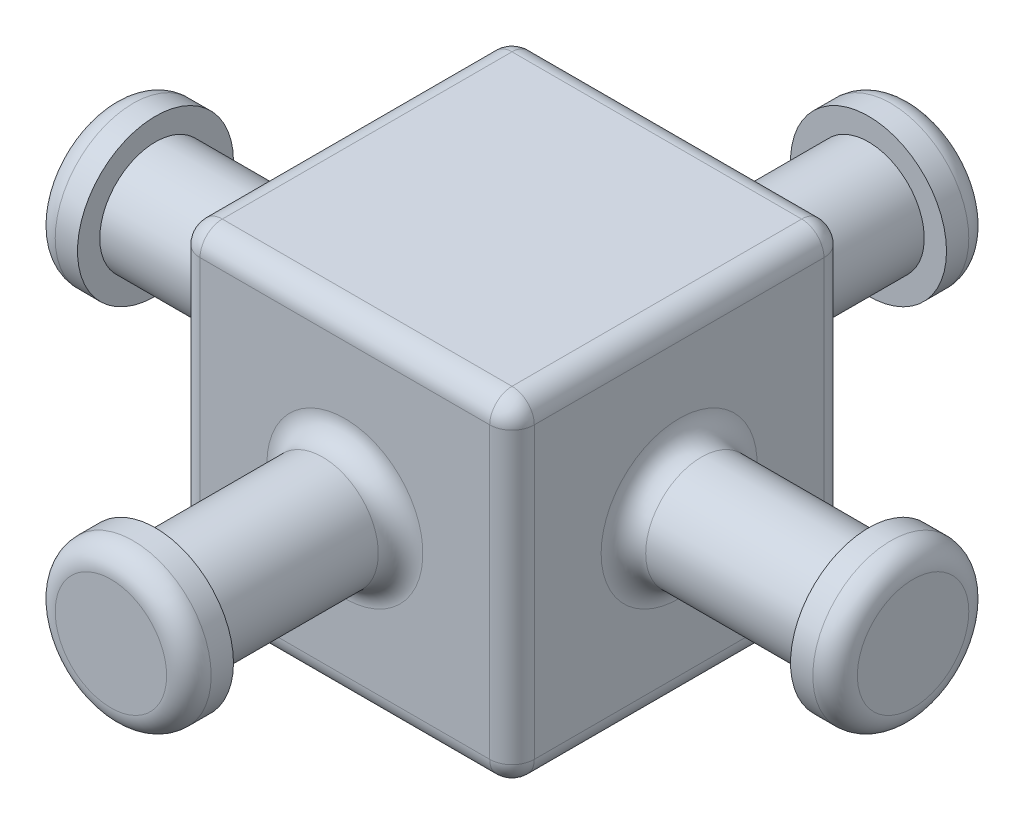
ISO-10303-21;
HEADER;
FILE_DESCRIPTION(('STEP AP214'),'2;1');
FILE_NAME('part.step','',(''),(''),'','','');
FILE_SCHEMA(('AUTOMOTIVE_DESIGN { 1 0 10303 214 1 1 1 1 }'));
ENDSEC;
DATA;
#1=APPLICATION_CONTEXT('core data for automotive mechanical design processes');
#2=APPLICATION_PROTOCOL_DEFINITION('international standard','automotive_design',2000,#1);
#3=PRODUCT_CONTEXT('',#1,'mechanical');
#4=PRODUCT('Part','Part','',(#3));
#5=PRODUCT_RELATED_PRODUCT_CATEGORY('part','',(#4));
#6=PRODUCT_DEFINITION_FORMATION('','',#4);
#7=PRODUCT_DEFINITION_CONTEXT('part definition',#1,'design');
#8=PRODUCT_DEFINITION('design','',#6,#7);
#9=PRODUCT_DEFINITION_SHAPE('','',#8);
#10=(LENGTH_UNIT() NAMED_UNIT(*) SI_UNIT(.MILLI.,.METRE.));
#11=(NAMED_UNIT(*) PLANE_ANGLE_UNIT() SI_UNIT($,.RADIAN.));
#12=(NAMED_UNIT(*) SI_UNIT($,.STERADIAN.) SOLID_ANGLE_UNIT());
#13=UNCERTAINTY_MEASURE_WITH_UNIT(LENGTH_MEASURE(1.E-05),#10,'distance_accuracy_value','');
#14=(GEOMETRIC_REPRESENTATION_CONTEXT(3) GLOBAL_UNCERTAINTY_ASSIGNED_CONTEXT((#13)) GLOBAL_UNIT_ASSIGNED_CONTEXT((#10,
#11,#12)) REPRESENTATION_CONTEXT('',''));
#15=CARTESIAN_POINT('',(0.,0.,0.));
#16=DIRECTION('',(0.,0.,1.));
#17=DIRECTION('',(1.,0.,0.));
#18=AXIS2_PLACEMENT_3D('',#15,#16,#17);
#19=CARTESIAN_POINT('',(0.,0.,20.32));
#20=DIRECTION('',(0.,0.,-1.));
#21=DIRECTION('',(-1.,0.,0.));
#22=AXIS2_PLACEMENT_3D('',#19,#20,#21);
#23=CYLINDRICAL_SURFACE('',#22,3.175);
#24=CARTESIAN_POINT('',(0.,0.,10.795));
#25=DIRECTION('',(0.,0.,-1.));
#26=DIRECTION('',(-1.,0.,0.));
#27=AXIS2_PLACEMENT_3D('',#24,#25,#26);
#28=CIRCLE('',#27,3.175);
#29=CARTESIAN_POINT('',(-3.175,0.,10.795));
#30=VERTEX_POINT('',#29);
#31=EDGE_CURVE('E166',#30,#30,#28,.F.);
#32=ORIENTED_EDGE('',*,*,#31,.T.);
#33=EDGE_LOOP('',(#32));
#34=FACE_BOUND('',#33,.T.);
#35=CARTESIAN_POINT('',(0.,0.,20.32));
#36=DIRECTION('',(0.,0.,1.));
#37=DIRECTION('',(1.,0.,0.));
#38=AXIS2_PLACEMENT_3D('',#35,#36,#37);
#39=CIRCLE('',#38,3.175);
#40=CARTESIAN_POINT('',(3.175,0.,20.32));
#41=VERTEX_POINT('',#40);
#42=EDGE_CURVE('E309',#41,#41,#39,.T.);
#43=ORIENTED_EDGE('',*,*,#42,.F.);
#44=EDGE_LOOP('',(#43));
#45=FACE_BOUND('',#44,.T.);
#46=ADVANCED_FACE('F35',(#34,#45),#23,.T.);
#47=CARTESIAN_POINT('',(0.,0.,20.32));
#48=DIRECTION('',(0.,0.,1.));
#49=DIRECTION('',(1.,0.,0.));
#50=AXIS2_PLACEMENT_3D('',#47,#48,#49);
#51=PLANE('',#50);
#52=CARTESIAN_POINT('',(0.,0.,20.32));
#53=DIRECTION('',(0.,0.,1.));
#54=DIRECTION('',(1.,0.,0.));
#55=AXIS2_PLACEMENT_3D('',#52,#53,#54);
#56=CIRCLE('',#55,4.445);
#57=CARTESIAN_POINT('',(4.445,0.,20.32));
#58=VERTEX_POINT('',#57);
#59=EDGE_CURVE('E306',#58,#58,#56,.T.);
#60=ORIENTED_EDGE('',*,*,#59,.F.);
#61=EDGE_LOOP('',(#60));
#62=FACE_BOUND('',#61,.T.);
#63=ORIENTED_EDGE('',*,*,#42,.T.);
#64=EDGE_LOOP('',(#63));
#65=FACE_BOUND('',#64,.T.);
#66=ADVANCED_FACE('F388',(#62,#65),#51,.F.);
#67=CARTESIAN_POINT('',(0.,0.,22.86));
#68=DIRECTION('',(0.,0.,-1.));
#69=DIRECTION('',(-1.,0.,0.));
#70=AXIS2_PLACEMENT_3D('',#67,#68,#69);
#71=CYLINDRICAL_SURFACE('',#70,4.445);
#72=CARTESIAN_POINT('',(0.,0.,21.59));
#73=DIRECTION('',(0.,0.,1.));
#74=DIRECTION('',(1.,0.,0.));
#75=AXIS2_PLACEMENT_3D('',#72,#73,#74);
#76=CIRCLE('',#75,4.445);
#77=CARTESIAN_POINT('',(4.445,0.,21.59));
#78=VERTEX_POINT('',#77);
#79=EDGE_CURVE('E315',#78,#78,#76,.F.);
#80=ORIENTED_EDGE('',*,*,#79,.T.);
#81=EDGE_LOOP('',(#80));
#82=FACE_BOUND('',#81,.T.);
#83=ORIENTED_EDGE('',*,*,#59,.T.);
#84=EDGE_LOOP('',(#83));
#85=FACE_BOUND('',#84,.T.);
#86=ADVANCED_FACE('F395',(#82,#85),#71,.T.);
#87=CARTESIAN_POINT('',(0.,0.,22.86));
#88=DIRECTION('',(0.,0.,1.));
#89=DIRECTION('',(1.,0.,0.));
#90=AXIS2_PLACEMENT_3D('',#87,#88,#89);
#91=PLANE('',#90);
#92=CARTESIAN_POINT('',(0.,0.,22.86));
#93=DIRECTION('',(0.,0.,1.));
#94=DIRECTION('',(1.,0.,0.));
#95=AXIS2_PLACEMENT_3D('',#92,#93,#94);
#96=CIRCLE('',#95,3.175);
#97=CARTESIAN_POINT('',(3.175,0.,22.86));
#98=VERTEX_POINT('',#97);
#99=EDGE_CURVE('E312',#98,#98,#96,.T.);
#100=ORIENTED_EDGE('',*,*,#99,.T.);
#101=EDGE_LOOP('',(#100));
#102=FACE_BOUND('',#101,.T.);
#103=ADVANCED_FACE('F512',(#102),#91,.T.);
#104=CARTESIAN_POINT('',(0.,0.,21.59));
#105=DIRECTION('',(0.,0.,1.));
#106=DIRECTION('',(1.,0.,0.));
#107=AXIS2_PLACEMENT_3D('',#104,#105,#106);
#108=TOROIDAL_SURFACE('',#107,3.175,1.27);
#109=ORIENTED_EDGE('',*,*,#79,.F.);
#110=EDGE_LOOP('',(#109));
#111=FACE_BOUND('',#110,.T.);
#112=ORIENTED_EDGE('',*,*,#99,.F.);
#113=EDGE_LOOP('',(#112));
#114=FACE_BOUND('',#113,.T.);
#115=ADVANCED_FACE('F514',(#111,#114),#108,.T.);
#116=CARTESIAN_POINT('',(9.525,-9.525,9.525));
#117=DIRECTION('',(0.,0.,-1.));
#118=DIRECTION('',(-1.,0.,0.));
#119=AXIS2_PLACEMENT_3D('',#116,#117,#118);
#120=PLANE('',#119);
#121=CARTESIAN_POINT('',(0.,0.,9.525));
#122=DIRECTION('',(0.,0.,-1.));
#123=DIRECTION('',(-1.,0.,0.));
#124=AXIS2_PLACEMENT_3D('',#121,#122,#123);
#125=CIRCLE('',#124,4.445);
#126=CARTESIAN_POINT('',(-4.445,0.,9.525));
#127=VERTEX_POINT('',#126);
#128=EDGE_CURVE('E163',#127,#127,#125,.T.);
#129=ORIENTED_EDGE('',*,*,#128,.T.);
#130=EDGE_LOOP('',(#129));
#131=FACE_BOUND('',#130,.T.);
#132=DIRECTION('',(0.,-1.,0.));
#133=VECTOR('',#132,1.);
#134=CARTESIAN_POINT('',(-8.255,-9.525,9.525));
#135=LINE('',#134,#133);
#136=CARTESIAN_POINT('',(-8.255,8.255,9.525));
#137=VERTEX_POINT('',#136);
#138=CARTESIAN_POINT('',(-8.255,-8.255,9.525));
#139=VERTEX_POINT('',#138);
#140=EDGE_CURVE('E161',#137,#139,#135,.T.);
#141=ORIENTED_EDGE('',*,*,#140,.T.);
#142=DIRECTION('',(-1.,0.,0.));
#143=VECTOR('',#142,1.);
#144=CARTESIAN_POINT('',(9.525,-8.255,9.525));
#145=LINE('',#144,#143);
#146=CARTESIAN_POINT('',(8.255,-8.255,9.525));
#147=VERTEX_POINT('',#146);
#148=EDGE_CURVE('E131',#139,#147,#145,.F.);
#149=ORIENTED_EDGE('',*,*,#148,.T.);
#150=DIRECTION('',(0.,-1.,0.));
#151=VECTOR('',#150,1.);
#152=CARTESIAN_POINT('',(8.255,-9.525,9.525));
#153=LINE('',#152,#151);
#154=CARTESIAN_POINT('',(8.255,8.255,9.525));
#155=VERTEX_POINT('',#154);
#156=EDGE_CURVE('E150',#147,#155,#153,.F.);
#157=ORIENTED_EDGE('',*,*,#156,.T.);
#158=DIRECTION('',(-1.,0.,0.));
#159=VECTOR('',#158,1.);
#160=CARTESIAN_POINT('',(9.525,8.255,9.525));
#161=LINE('',#160,#159);
#162=EDGE_CURVE('E156',#155,#137,#161,.T.);
#163=ORIENTED_EDGE('',*,*,#162,.T.);
#164=EDGE_LOOP('',(#141,#149,#157,#163));
#165=FACE_BOUND('',#164,.T.);
#166=ADVANCED_FACE('F159',(#131,#165),#120,.F.);
#167=CARTESIAN_POINT('',(-9.525,0.,0.));
#168=DIRECTION('',(-1.,0.,0.));
#169=DIRECTION('',(0.,0.,1.));
#170=AXIS2_PLACEMENT_3D('',#167,#168,#169);
#171=PLANE('',#170);
#172=CARTESIAN_POINT('',(-9.525,0.,0.));
#173=DIRECTION('',(-1.,0.,0.));
#174=DIRECTION('',(0.,0.,1.));
#175=AXIS2_PLACEMENT_3D('',#172,#173,#174);
#176=CIRCLE('',#175,4.445);
#177=CARTESIAN_POINT('',(-9.525,0.,4.445));
#178=VERTEX_POINT('',#177);
#179=EDGE_CURVE('E192',#178,#178,#176,.F.);
#180=ORIENTED_EDGE('',*,*,#179,.T.);
#181=EDGE_LOOP('',(#180));
#182=FACE_BOUND('',#181,.T.);
#183=DIRECTION('',(0.,0.,-1.));
#184=VECTOR('',#183,1.);
#185=CARTESIAN_POINT('',(-9.525,-8.255,9.525));
#186=LINE('',#185,#184);
#187=CARTESIAN_POINT('',(-9.525,-8.255,-8.255));
#188=VERTEX_POINT('',#187);
#189=CARTESIAN_POINT('',(-9.525,-8.255,8.255));
#190=VERTEX_POINT('',#189);
#191=EDGE_CURVE('E187',#188,#190,#186,.F.);
#192=ORIENTED_EDGE('',*,*,#191,.T.);
#193=DIRECTION('',(0.,-1.,0.));
#194=VECTOR('',#193,1.);
#195=CARTESIAN_POINT('',(-9.525,9.525,8.255));
#196=LINE('',#195,#194);
#197=CARTESIAN_POINT('',(-9.525,8.255,8.255));
#198=VERTEX_POINT('',#197);
#199=EDGE_CURVE('E189',#190,#198,#196,.F.);
#200=ORIENTED_EDGE('',*,*,#199,.T.);
#201=DIRECTION('',(0.,0.,1.));
#202=VECTOR('',#201,1.);
#203=CARTESIAN_POINT('',(-9.525,8.255,-9.525));
#204=LINE('',#203,#202);
#205=CARTESIAN_POINT('',(-9.525,8.255,-8.255));
#206=VERTEX_POINT('',#205);
#207=EDGE_CURVE('E185',#198,#206,#204,.F.);
#208=ORIENTED_EDGE('',*,*,#207,.T.);
#209=DIRECTION('',(0.,1.,0.));
#210=VECTOR('',#209,1.);
#211=CARTESIAN_POINT('',(-9.525,-9.525,-8.255));
#212=LINE('',#211,#210);
#213=EDGE_CURVE('E183',#206,#188,#212,.F.);
#214=ORIENTED_EDGE('',*,*,#213,.T.);
#215=EDGE_LOOP('',(#192,#200,#208,#214));
#216=FACE_BOUND('',#215,.T.);
#217=ADVANCED_FACE('F429',(#182,#216),#171,.T.);
#218=CARTESIAN_POINT('',(9.525,-9.525,-9.525));
#219=DIRECTION('',(0.,0.,1.));
#220=DIRECTION('',(1.,0.,0.));
#221=AXIS2_PLACEMENT_3D('',#218,#219,#220);
#222=PLANE('',#221);
#223=CARTESIAN_POINT('',(0.,0.,-9.525));
#224=DIRECTION('',(0.,0.,1.));
#225=DIRECTION('',(1.,0.,0.));
#226=AXIS2_PLACEMENT_3D('',#223,#224,#225);
#227=CIRCLE('',#226,4.445);
#228=CARTESIAN_POINT('',(4.445,0.,-9.525));
#229=VERTEX_POINT('',#228);
#230=EDGE_CURVE('E213',#229,#229,#227,.T.);
#231=ORIENTED_EDGE('',*,*,#230,.T.);
#232=EDGE_LOOP('',(#231));
#233=FACE_BOUND('',#232,.T.);
#234=DIRECTION('',(-1.,0.,0.));
#235=VECTOR('',#234,1.);
#236=CARTESIAN_POINT('',(9.525,-8.255,-9.525));
#237=LINE('',#236,#235);
#238=CARTESIAN_POINT('',(8.255,-8.255,-9.525));
#239=VERTEX_POINT('',#238);
#240=CARTESIAN_POINT('',(-8.255,-8.255,-9.525));
#241=VERTEX_POINT('',#240);
#242=EDGE_CURVE('E208',#239,#241,#237,.T.);
#243=ORIENTED_EDGE('',*,*,#242,.T.);
#244=DIRECTION('',(0.,1.,0.));
#245=VECTOR('',#244,1.);
#246=CARTESIAN_POINT('',(-8.255,9.525,-9.525));
#247=LINE('',#246,#245);
#248=CARTESIAN_POINT('',(-8.255,8.255,-9.525));
#249=VERTEX_POINT('',#248);
#250=EDGE_CURVE('E211',#241,#249,#247,.T.);
#251=ORIENTED_EDGE('',*,*,#250,.T.);
#252=DIRECTION('',(-1.,0.,0.));
#253=VECTOR('',#252,1.);
#254=CARTESIAN_POINT('',(9.525,8.255,-9.525));
#255=LINE('',#254,#253);
#256=CARTESIAN_POINT('',(8.255,8.255,-9.525));
#257=VERTEX_POINT('',#256);
#258=EDGE_CURVE('E206',#249,#257,#255,.F.);
#259=ORIENTED_EDGE('',*,*,#258,.T.);
#260=DIRECTION('',(0.,1.,0.));
#261=VECTOR('',#260,1.);
#262=CARTESIAN_POINT('',(8.255,-9.525,-9.525));
#263=LINE('',#262,#261);
#264=EDGE_CURVE('E204',#257,#239,#263,.F.);
#265=ORIENTED_EDGE('',*,*,#264,.T.);
#266=EDGE_LOOP('',(#243,#251,#259,#265));
#267=FACE_BOUND('',#266,.T.);
#268=ADVANCED_FACE('F426',(#233,#267),#222,.F.);
#269=CARTESIAN_POINT('',(9.525,0.,0.));
#270=DIRECTION('',(-1.,0.,0.));
#271=DIRECTION('',(0.,0.,1.));
#272=AXIS2_PLACEMENT_3D('',#269,#270,#271);
#273=PLANE('',#272);
#274=CARTESIAN_POINT('',(9.525,0.,0.));
#275=DIRECTION('',(-1.,0.,0.));
#276=DIRECTION('',(0.,0.,1.));
#277=AXIS2_PLACEMENT_3D('',#274,#275,#276);
#278=CIRCLE('',#277,4.445);
#279=CARTESIAN_POINT('',(9.525,0.,4.445));
#280=VERTEX_POINT('',#279);
#281=EDGE_CURVE('E44',#280,#280,#278,.T.);
#282=ORIENTED_EDGE('',*,*,#281,.T.);
#283=EDGE_LOOP('',(#282));
#284=FACE_BOUND('',#283,.T.);
#285=DIRECTION('',(0.,-1.,0.));
#286=VECTOR('',#285,1.);
#287=CARTESIAN_POINT('',(9.525,0.,8.255));
#288=LINE('',#287,#286);
#289=CARTESIAN_POINT('',(9.525,8.255,8.255));
#290=VERTEX_POINT('',#289);
#291=CARTESIAN_POINT('',(9.525,-8.255,8.255));
#292=VERTEX_POINT('',#291);
#293=EDGE_CURVE('E52',#290,#292,#288,.T.);
#294=ORIENTED_EDGE('',*,*,#293,.T.);
#295=DIRECTION('',(0.,0.,-1.));
#296=VECTOR('',#295,1.);
#297=CARTESIAN_POINT('',(9.525,-8.255,0.));
#298=LINE('',#297,#296);
#299=CARTESIAN_POINT('',(9.525,-8.255,-8.255));
#300=VERTEX_POINT('',#299);
#301=EDGE_CURVE('E223',#292,#300,#298,.T.);
#302=ORIENTED_EDGE('',*,*,#301,.T.);
#303=DIRECTION('',(0.,1.,0.));
#304=VECTOR('',#303,1.);
#305=CARTESIAN_POINT('',(9.525,0.,-8.255));
#306=LINE('',#305,#304);
#307=CARTESIAN_POINT('',(9.525,8.255,-8.255));
#308=VERTEX_POINT('',#307);
#309=EDGE_CURVE('E219',#300,#308,#306,.T.);
#310=ORIENTED_EDGE('',*,*,#309,.T.);
#311=DIRECTION('',(0.,0.,1.));
#312=VECTOR('',#311,1.);
#313=CARTESIAN_POINT('',(9.525,8.255,0.));
#314=LINE('',#313,#312);
#315=EDGE_CURVE('E57',#308,#290,#314,.T.);
#316=ORIENTED_EDGE('',*,*,#315,.T.);
#317=EDGE_LOOP('',(#294,#302,#310,#316));
#318=FACE_BOUND('',#317,.T.);
#319=ADVANCED_FACE('F363',(#284,#318),#273,.F.);
#320=CARTESIAN_POINT('',(9.525,9.525,9.525));
#321=DIRECTION('',(0.,-1.,0.));
#322=DIRECTION('',(0.,0.,-1.));
#323=AXIS2_PLACEMENT_3D('',#320,#321,#322);
#324=PLANE('',#323);
#325=DIRECTION('',(0.,0.,1.));
#326=VECTOR('',#325,1.);
#327=CARTESIAN_POINT('',(-8.255,9.525,9.525));
#328=LINE('',#327,#326);
#329=CARTESIAN_POINT('',(-8.255,9.525,-8.255));
#330=VERTEX_POINT('',#329);
#331=CARTESIAN_POINT('',(-8.255,9.525,8.255));
#332=VERTEX_POINT('',#331);
#333=EDGE_CURVE('E199',#330,#332,#328,.T.);
#334=ORIENTED_EDGE('',*,*,#333,.T.);
#335=DIRECTION('',(-1.,0.,0.));
#336=VECTOR('',#335,1.);
#337=CARTESIAN_POINT('',(9.525,9.525,8.255));
#338=LINE('',#337,#336);
#339=CARTESIAN_POINT('',(8.255,9.525,8.255));
#340=VERTEX_POINT('',#339);
#341=EDGE_CURVE('E201',#332,#340,#338,.F.);
#342=ORIENTED_EDGE('',*,*,#341,.T.);
#343=DIRECTION('',(0.,0.,1.));
#344=VECTOR('',#343,1.);
#345=CARTESIAN_POINT('',(8.255,9.525,9.525));
#346=LINE('',#345,#344);
#347=CARTESIAN_POINT('',(8.255,9.525,-8.255));
#348=VERTEX_POINT('',#347);
#349=EDGE_CURVE('E195',#340,#348,#346,.F.);
#350=ORIENTED_EDGE('',*,*,#349,.T.);
#351=DIRECTION('',(-1.,0.,0.));
#352=VECTOR('',#351,1.);
#353=CARTESIAN_POINT('',(9.525,9.525,-8.255));
#354=LINE('',#353,#352);
#355=EDGE_CURVE('E197',#348,#330,#354,.T.);
#356=ORIENTED_EDGE('',*,*,#355,.T.);
#357=EDGE_LOOP('',(#334,#342,#350,#356));
#358=FACE_BOUND('',#357,.T.);
#359=ADVANCED_FACE('F446',(#358),#324,.F.);
#360=CARTESIAN_POINT('',(9.525,-9.525,9.525));
#361=DIRECTION('',(0.,1.,0.));
#362=DIRECTION('',(0.,0.,1.));
#363=AXIS2_PLACEMENT_3D('',#360,#361,#362);
#364=PLANE('',#363);
#365=DIRECTION('',(0.,0.,-1.));
#366=VECTOR('',#365,1.);
#367=CARTESIAN_POINT('',(8.255,-9.525,9.525));
#368=LINE('',#367,#366);
#369=CARTESIAN_POINT('',(8.255,-9.525,-8.255));
#370=VERTEX_POINT('',#369);
#371=CARTESIAN_POINT('',(8.255,-9.525,8.255));
#372=VERTEX_POINT('',#371);
#373=EDGE_CURVE('E173',#370,#372,#368,.F.);
#374=ORIENTED_EDGE('',*,*,#373,.T.);
#375=DIRECTION('',(-1.,0.,0.));
#376=VECTOR('',#375,1.);
#377=CARTESIAN_POINT('',(9.525,-9.525,8.255));
#378=LINE('',#377,#376);
#379=CARTESIAN_POINT('',(-8.255,-9.525,8.255));
#380=VERTEX_POINT('',#379);
#381=EDGE_CURVE('E134',#372,#380,#378,.T.);
#382=ORIENTED_EDGE('',*,*,#381,.T.);
#383=DIRECTION('',(0.,0.,-1.));
#384=VECTOR('',#383,1.);
#385=CARTESIAN_POINT('',(-8.255,-9.525,-9.525));
#386=LINE('',#385,#384);
#387=CARTESIAN_POINT('',(-8.255,-9.525,-8.255));
#388=VERTEX_POINT('',#387);
#389=EDGE_CURVE('E177',#380,#388,#386,.T.);
#390=ORIENTED_EDGE('',*,*,#389,.T.);
#391=DIRECTION('',(-1.,0.,0.));
#392=VECTOR('',#391,1.);
#393=CARTESIAN_POINT('',(9.525,-9.525,-8.255));
#394=LINE('',#393,#392);
#395=EDGE_CURVE('E175',#388,#370,#394,.F.);
#396=ORIENTED_EDGE('',*,*,#395,.T.);
#397=EDGE_LOOP('',(#374,#382,#390,#396));
#398=FACE_BOUND('',#397,.T.);
#399=ADVANCED_FACE('F357',(#398),#364,.F.);
#400=CARTESIAN_POINT('',(22.86,0.,0.));
#401=DIRECTION('',(1.,0.,0.));
#402=DIRECTION('',(0.,0.,-1.));
#403=AXIS2_PLACEMENT_3D('',#400,#401,#402);
#404=PLANE('',#403);
#405=CARTESIAN_POINT('',(22.86,0.,0.));
#406=DIRECTION('',(1.,0.,0.));
#407=DIRECTION('',(0.,0.,-1.));
#408=AXIS2_PLACEMENT_3D('',#405,#406,#407);
#409=CIRCLE('',#408,3.175);
#410=CARTESIAN_POINT('',(22.86,0.,-3.175));
#411=VERTEX_POINT('',#410);
#412=EDGE_CURVE('E324',#411,#411,#409,.T.);
#413=ORIENTED_EDGE('',*,*,#412,.T.);
#414=EDGE_LOOP('',(#413));
#415=FACE_BOUND('',#414,.T.);
#416=ADVANCED_FACE('F489',(#415),#404,.T.);
#417=CARTESIAN_POINT('',(21.59,0.,0.));
#418=DIRECTION('',(1.,0.,0.));
#419=DIRECTION('',(0.,0.,-1.));
#420=AXIS2_PLACEMENT_3D('',#417,#418,#419);
#421=TOROIDAL_SURFACE('',#420,3.175,1.27);
#422=CARTESIAN_POINT('',(21.59,0.,0.));
#423=DIRECTION('',(1.,0.,0.));
#424=DIRECTION('',(0.,0.,-1.));
#425=AXIS2_PLACEMENT_3D('',#422,#423,#424);
#426=CIRCLE('',#425,4.445);
#427=CARTESIAN_POINT('',(21.59,0.,-4.445));
#428=VERTEX_POINT('',#427);
#429=EDGE_CURVE('E327',#428,#428,#426,.F.);
#430=ORIENTED_EDGE('',*,*,#429,.F.);
#431=EDGE_LOOP('',(#430));
#432=FACE_BOUND('',#431,.T.);
#433=ORIENTED_EDGE('',*,*,#412,.F.);
#434=EDGE_LOOP('',(#433));
#435=FACE_BOUND('',#434,.T.);
#436=ADVANCED_FACE('F492',(#432,#435),#421,.T.);
#437=CARTESIAN_POINT('',(22.86,0.,0.));
#438=DIRECTION('',(-1.,0.,0.));
#439=DIRECTION('',(0.,0.,1.));
#440=AXIS2_PLACEMENT_3D('',#437,#438,#439);
#441=CYLINDRICAL_SURFACE('',#440,4.445);
#442=ORIENTED_EDGE('',*,*,#429,.T.);
#443=EDGE_LOOP('',(#442));
#444=FACE_BOUND('',#443,.T.);
#445=CARTESIAN_POINT('',(20.32,0.,0.));
#446=DIRECTION('',(1.,0.,0.));
#447=DIRECTION('',(0.,0.,-1.));
#448=AXIS2_PLACEMENT_3D('',#445,#446,#447);
#449=CIRCLE('',#448,4.445);
#450=CARTESIAN_POINT('',(20.32,0.,-4.445));
#451=VERTEX_POINT('',#450);
#452=EDGE_CURVE('E292',#451,#451,#449,.T.);
#453=ORIENTED_EDGE('',*,*,#452,.T.);
#454=EDGE_LOOP('',(#453));
#455=FACE_BOUND('',#454,.T.);
#456=ADVANCED_FACE('F497',(#444,#455),#441,.T.);
#457=CARTESIAN_POINT('',(20.32,0.,0.));
#458=DIRECTION('',(1.,0.,0.));
#459=DIRECTION('',(0.,0.,-1.));
#460=AXIS2_PLACEMENT_3D('',#457,#458,#459);
#461=PLANE('',#460);
#462=ORIENTED_EDGE('',*,*,#452,.F.);
#463=EDGE_LOOP('',(#462));
#464=FACE_BOUND('',#463,.T.);
#465=CARTESIAN_POINT('',(20.32,0.,0.));
#466=DIRECTION('',(1.,0.,0.));
#467=DIRECTION('',(0.,0.,-1.));
#468=AXIS2_PLACEMENT_3D('',#465,#466,#467);
#469=CIRCLE('',#468,3.175);
#470=CARTESIAN_POINT('',(20.32,0.,-3.175));
#471=VERTEX_POINT('',#470);
#472=EDGE_CURVE('E297',#471,#471,#469,.T.);
#473=ORIENTED_EDGE('',*,*,#472,.T.);
#474=EDGE_LOOP('',(#473));
#475=FACE_BOUND('',#474,.T.);
#476=ADVANCED_FACE('F494',(#464,#475),#461,.F.);
#477=CARTESIAN_POINT('',(20.32,0.,0.));
#478=DIRECTION('',(-1.,0.,0.));
#479=DIRECTION('',(0.,0.,1.));
#480=AXIS2_PLACEMENT_3D('',#477,#478,#479);
#481=CYLINDRICAL_SURFACE('',#480,3.175);
#482=CARTESIAN_POINT('',(10.795,0.,0.));
#483=DIRECTION('',(-1.,0.,0.));
#484=DIRECTION('',(0.,0.,1.));
#485=AXIS2_PLACEMENT_3D('',#482,#483,#484);
#486=CIRCLE('',#485,3.175);
#487=CARTESIAN_POINT('',(10.795,0.,3.175));
#488=VERTEX_POINT('',#487);
#489=EDGE_CURVE('E11',#488,#488,#486,.F.);
#490=ORIENTED_EDGE('',*,*,#489,.T.);
#491=EDGE_LOOP('',(#490));
#492=FACE_BOUND('',#491,.T.);
#493=ORIENTED_EDGE('',*,*,#472,.F.);
#494=EDGE_LOOP('',(#493));
#495=FACE_BOUND('',#494,.T.);
#496=ADVANCED_FACE('F477',(#492,#495),#481,.T.);
#497=CARTESIAN_POINT('',(0.,0.,-22.86));
#498=DIRECTION('',(0.,0.,-1.));
#499=DIRECTION('',(1.,0.,0.));
#500=AXIS2_PLACEMENT_3D('',#497,#498,#499);
#501=PLANE('',#500);
#502=CARTESIAN_POINT('',(0.,0.,-22.86));
#503=DIRECTION('',(0.,0.,-1.));
#504=DIRECTION('',(-1.,0.,0.));
#505=AXIS2_PLACEMENT_3D('',#502,#503,#504);
#506=CIRCLE('',#505,3.175);
#507=CARTESIAN_POINT('',(-3.175,0.,-22.86));
#508=VERTEX_POINT('',#507);
#509=EDGE_CURVE('E321',#508,#508,#506,.T.);
#510=ORIENTED_EDGE('',*,*,#509,.T.);
#511=EDGE_LOOP('',(#510));
#512=FACE_BOUND('',#511,.T.);
#513=ADVANCED_FACE('F503',(#512),#501,.T.);
#514=CARTESIAN_POINT('',(0.,0.,-21.59));
#515=DIRECTION('',(0.,0.,-1.));
#516=DIRECTION('',(-1.,0.,0.));
#517=AXIS2_PLACEMENT_3D('',#514,#515,#516);
#518=TOROIDAL_SURFACE('',#517,3.175,1.27);
#519=ORIENTED_EDGE('',*,*,#509,.F.);
#520=EDGE_LOOP('',(#519));
#521=FACE_BOUND('',#520,.T.);
#522=CARTESIAN_POINT('',(0.,0.,-21.59));
#523=DIRECTION('',(0.,0.,-1.));
#524=DIRECTION('',(-1.,0.,0.));
#525=AXIS2_PLACEMENT_3D('',#522,#523,#524);
#526=CIRCLE('',#525,4.445);
#527=CARTESIAN_POINT('',(-4.445,0.,-21.59));
#528=VERTEX_POINT('',#527);
#529=EDGE_CURVE('E318',#528,#528,#526,.F.);
#530=ORIENTED_EDGE('',*,*,#529,.F.);
#531=EDGE_LOOP('',(#530));
#532=FACE_BOUND('',#531,.T.);
#533=ADVANCED_FACE('F506',(#521,#532),#518,.T.);
#534=CARTESIAN_POINT('',(0.,0.,-22.86));
#535=DIRECTION('',(0.,0.,1.));
#536=DIRECTION('',(1.,0.,0.));
#537=AXIS2_PLACEMENT_3D('',#534,#535,#536);
#538=CYLINDRICAL_SURFACE('',#537,4.445);
#539=ORIENTED_EDGE('',*,*,#529,.T.);
#540=EDGE_LOOP('',(#539));
#541=FACE_BOUND('',#540,.T.);
#542=CARTESIAN_POINT('',(0.,0.,-20.32));
#543=DIRECTION('',(0.,0.,1.));
#544=DIRECTION('',(1.,0.,0.));
#545=AXIS2_PLACEMENT_3D('',#542,#543,#544);
#546=CIRCLE('',#545,4.445);
#547=CARTESIAN_POINT('',(4.445,0.,-20.32));
#548=VERTEX_POINT('',#547);
#549=EDGE_CURVE('E300',#548,#548,#546,.T.);
#550=ORIENTED_EDGE('',*,*,#549,.F.);
#551=EDGE_LOOP('',(#550));
#552=FACE_BOUND('',#551,.T.);
#553=ADVANCED_FACE('F412',(#541,#552),#538,.T.);
#554=CARTESIAN_POINT('',(0.,0.,-20.32));
#555=DIRECTION('',(0.,0.,-1.));
#556=DIRECTION('',(1.,0.,0.));
#557=AXIS2_PLACEMENT_3D('',#554,#555,#556);
#558=PLANE('',#557);
#559=ORIENTED_EDGE('',*,*,#549,.T.);
#560=EDGE_LOOP('',(#559));
#561=FACE_BOUND('',#560,.T.);
#562=CARTESIAN_POINT('',(0.,0.,-20.32));
#563=DIRECTION('',(0.,0.,-1.));
#564=DIRECTION('',(-1.,0.,0.));
#565=AXIS2_PLACEMENT_3D('',#562,#563,#564);
#566=CIRCLE('',#565,3.175);
#567=CARTESIAN_POINT('',(-3.175,0.,-20.32));
#568=VERTEX_POINT('',#567);
#569=EDGE_CURVE('E303',#568,#568,#566,.T.);
#570=ORIENTED_EDGE('',*,*,#569,.T.);
#571=EDGE_LOOP('',(#570));
#572=FACE_BOUND('',#571,.T.);
#573=ADVANCED_FACE('F403',(#561,#572),#558,.F.);
#574=CARTESIAN_POINT('',(0.,0.,-10.795));
#575=DIRECTION('',(0.,0.,1.));
#576=DIRECTION('',(1.,0.,0.));
#577=AXIS2_PLACEMENT_3D('',#574,#575,#576);
#578=CIRCLE('',#577,3.175);
#579=CARTESIAN_POINT('',(3.175,0.,-10.795));
#580=VERTEX_POINT('',#579);
#581=EDGE_CURVE('E216',#580,#580,#578,.F.);
#582=ORIENTED_EDGE('',*,*,#581,.T.);
#583=EDGE_LOOP('',(#582));
#584=FACE_BOUND('',#583,.T.);
#585=ORIENTED_EDGE('',*,*,#569,.F.);
#586=EDGE_LOOP('',(#585));
#587=FACE_BOUND('',#586,.T.);
#588=ADVANCED_FACE('F391',(#584,#587),#23,.T.);
#589=CARTESIAN_POINT('',(-22.86,0.,0.));
#590=DIRECTION('',(-1.,0.,0.));
#591=DIRECTION('',(0.,0.,-1.));
#592=AXIS2_PLACEMENT_3D('',#589,#590,#591);
#593=PLANE('',#592);
#594=CARTESIAN_POINT('',(-22.86,0.,0.));
#595=DIRECTION('',(-1.,0.,0.));
#596=DIRECTION('',(0.,0.,1.));
#597=AXIS2_PLACEMENT_3D('',#594,#595,#596);
#598=CIRCLE('',#597,3.175);
#599=CARTESIAN_POINT('',(-22.86,0.,3.175));
#600=VERTEX_POINT('',#599);
#601=EDGE_CURVE('E157',#600,#600,#598,.T.);
#602=ORIENTED_EDGE('',*,*,#601,.T.);
#603=EDGE_LOOP('',(#602));
#604=FACE_BOUND('',#603,.T.);
#605=ADVANCED_FACE('F402',(#604),#593,.T.);
#606=CARTESIAN_POINT('',(-21.59,0.,0.));
#607=DIRECTION('',(-1.,0.,0.));
#608=DIRECTION('',(0.,0.,1.));
#609=AXIS2_PLACEMENT_3D('',#606,#607,#608);
#610=TOROIDAL_SURFACE('',#609,3.175,1.27);
#611=ORIENTED_EDGE('',*,*,#601,.F.);
#612=EDGE_LOOP('',(#611));
#613=FACE_BOUND('',#612,.T.);
#614=CARTESIAN_POINT('',(-21.59,0.,0.));
#615=DIRECTION('',(-1.,0.,0.));
#616=DIRECTION('',(0.,0.,1.));
#617=AXIS2_PLACEMENT_3D('',#614,#615,#616);
#618=CIRCLE('',#617,4.445);
#619=CARTESIAN_POINT('',(-21.59,0.,4.445));
#620=VERTEX_POINT('',#619);
#621=EDGE_CURVE('E330',#620,#620,#618,.F.);
#622=ORIENTED_EDGE('',*,*,#621,.F.);
#623=EDGE_LOOP('',(#622));
#624=FACE_BOUND('',#623,.T.);
#625=ADVANCED_FACE('F409',(#613,#624),#610,.T.);
#626=CARTESIAN_POINT('',(-22.86,0.,0.));
#627=DIRECTION('',(1.,0.,0.));
#628=DIRECTION('',(0.,0.,-1.));
#629=AXIS2_PLACEMENT_3D('',#626,#627,#628);
#630=CYLINDRICAL_SURFACE('',#629,4.445);
#631=ORIENTED_EDGE('',*,*,#621,.T.);
#632=EDGE_LOOP('',(#631));
#633=FACE_BOUND('',#632,.T.);
#634=CARTESIAN_POINT('',(-20.32,0.,0.));
#635=DIRECTION('',(1.,0.,0.));
#636=DIRECTION('',(0.,0.,-1.));
#637=AXIS2_PLACEMENT_3D('',#634,#635,#636);
#638=CIRCLE('',#637,4.445);
#639=CARTESIAN_POINT('',(-20.32,0.,-4.445));
#640=VERTEX_POINT('',#639);
#641=EDGE_CURVE('E281',#640,#640,#638,.T.);
#642=ORIENTED_EDGE('',*,*,#641,.F.);
#643=EDGE_LOOP('',(#642));
#644=FACE_BOUND('',#643,.T.);
#645=ADVANCED_FACE('F481',(#633,#644),#630,.T.);
#646=CARTESIAN_POINT('',(-20.32,0.,0.));
#647=DIRECTION('',(-1.,0.,0.));
#648=DIRECTION('',(0.,0.,-1.));
#649=AXIS2_PLACEMENT_3D('',#646,#647,#648);
#650=PLANE('',#649);
#651=ORIENTED_EDGE('',*,*,#641,.T.);
#652=EDGE_LOOP('',(#651));
#653=FACE_BOUND('',#652,.T.);
#654=CARTESIAN_POINT('',(-20.32,0.,0.));
#655=DIRECTION('',(-1.,0.,0.));
#656=DIRECTION('',(0.,0.,1.));
#657=AXIS2_PLACEMENT_3D('',#654,#655,#656);
#658=CIRCLE('',#657,3.175);
#659=CARTESIAN_POINT('',(-20.32,0.,3.175));
#660=VERTEX_POINT('',#659);
#661=EDGE_CURVE('E287',#660,#660,#658,.T.);
#662=ORIENTED_EDGE('',*,*,#661,.T.);
#663=EDGE_LOOP('',(#662));
#664=FACE_BOUND('',#663,.T.);
#665=ADVANCED_FACE('F475',(#653,#664),#650,.F.);
#666=CARTESIAN_POINT('',(-10.795,0.,0.));
#667=DIRECTION('',(-1.,0.,0.));
#668=DIRECTION('',(0.,0.,1.));
#669=AXIS2_PLACEMENT_3D('',#666,#667,#668);
#670=CIRCLE('',#669,3.175);
#671=CARTESIAN_POINT('',(-10.795,0.,3.175));
#672=VERTEX_POINT('',#671);
#673=EDGE_CURVE('E180',#672,#672,#670,.T.);
#674=ORIENTED_EDGE('',*,*,#673,.T.);
#675=EDGE_LOOP('',(#674));
#676=FACE_BOUND('',#675,.T.);
#677=ORIENTED_EDGE('',*,*,#661,.F.);
#678=EDGE_LOOP('',(#677));
#679=FACE_BOUND('',#678,.T.);
#680=ADVANCED_FACE('F458',(#676,#679),#481,.T.);
#681=CARTESIAN_POINT('',(0.,0.,10.795));
#682=DIRECTION('',(0.,0.,-1.));
#683=DIRECTION('',(-1.,0.,0.));
#684=AXIS2_PLACEMENT_3D('',#681,#682,#683);
#685=TOROIDAL_SURFACE('',#684,4.445,1.27);
#686=ORIENTED_EDGE('',*,*,#31,.F.);
#687=EDGE_LOOP('',(#686));
#688=FACE_BOUND('',#687,.T.);
#689=ORIENTED_EDGE('',*,*,#128,.F.);
#690=EDGE_LOOP('',(#689));
#691=FACE_BOUND('',#690,.T.);
#692=ADVANCED_FACE('F451',(#688,#691),#685,.F.);
#693=CARTESIAN_POINT('',(9.525,8.255,-8.255));
#694=DIRECTION('',(-1.,0.,0.));
#695=DIRECTION('',(0.,0.,1.));
#696=AXIS2_PLACEMENT_3D('',#693,#694,#695);
#697=CYLINDRICAL_SURFACE('',#696,1.27);
#698=CARTESIAN_POINT('',(8.255,8.255,-8.255));
#699=DIRECTION('',(1.,0.,0.));
#700=DIRECTION('',(0.,0.,-1.));
#701=AXIS2_PLACEMENT_3D('',#698,#699,#700);
#702=CIRCLE('',#701,1.27);
#703=EDGE_CURVE('E39',#257,#348,#702,.T.);
#704=ORIENTED_EDGE('',*,*,#703,.F.);
#705=ORIENTED_EDGE('',*,*,#258,.F.);
#706=CARTESIAN_POINT('',(-8.255,8.255,-8.255));
#707=DIRECTION('',(-1.,0.,0.));
#708=DIRECTION('',(0.,0.,1.));
#709=AXIS2_PLACEMENT_3D('',#706,#707,#708);
#710=CIRCLE('',#709,1.27);
#711=EDGE_CURVE('E274',#330,#249,#710,.T.);
#712=ORIENTED_EDGE('',*,*,#711,.F.);
#713=ORIENTED_EDGE('',*,*,#355,.F.);
#714=EDGE_LOOP('',(#704,#705,#712,#713));
#715=FACE_BOUND('',#714,.T.);
#716=ADVANCED_FACE('F449',(#715),#697,.T.);
#717=CARTESIAN_POINT('',(8.255,8.255,-8.255));
#718=DIRECTION('',(0.,0.,1.));
#719=DIRECTION('',(1.,0.,0.));
#720=AXIS2_PLACEMENT_3D('',#717,#718,#719);
#721=SPHERICAL_SURFACE('',#720,1.27);
#722=CARTESIAN_POINT('',(8.255,8.255,-8.255));
#723=DIRECTION('',(0.,1.,0.));
#724=DIRECTION('',(0.,0.,1.));
#725=AXIS2_PLACEMENT_3D('',#722,#723,#724);
#726=CIRCLE('',#725,1.27);
#727=EDGE_CURVE('E269',#257,#308,#726,.F.);
#728=ORIENTED_EDGE('',*,*,#727,.F.);
#729=ORIENTED_EDGE('',*,*,#703,.T.);
#730=CARTESIAN_POINT('',(8.255,8.255,-8.255));
#731=DIRECTION('',(0.,0.,-1.));
#732=DIRECTION('',(-1.,0.,0.));
#733=AXIS2_PLACEMENT_3D('',#730,#731,#732);
#734=CIRCLE('',#733,1.27);
#735=EDGE_CURVE('E272',#308,#348,#734,.F.);
#736=ORIENTED_EDGE('',*,*,#735,.F.);
#737=EDGE_LOOP('',(#728,#729,#736));
#738=FACE_BOUND('',#737,.T.);
#739=ADVANCED_FACE('F369',(#738),#721,.T.);
#740=CARTESIAN_POINT('',(-8.255,8.255,-8.255));
#741=DIRECTION('',(0.,0.,1.));
#742=DIRECTION('',(1.,0.,0.));
#743=AXIS2_PLACEMENT_3D('',#740,#741,#742);
#744=SPHERICAL_SURFACE('',#743,1.27);
#745=CARTESIAN_POINT('',(-8.255,8.255,-8.255));
#746=DIRECTION('',(0.,0.,-1.));
#747=DIRECTION('',(-1.,0.,0.));
#748=AXIS2_PLACEMENT_3D('',#745,#746,#747);
#749=CIRCLE('',#748,1.27);
#750=EDGE_CURVE('E263',#330,#206,#749,.F.);
#751=ORIENTED_EDGE('',*,*,#750,.F.);
#752=ORIENTED_EDGE('',*,*,#711,.T.);
#753=CARTESIAN_POINT('',(-8.255,8.255,-8.255));
#754=DIRECTION('',(0.,1.,0.));
#755=DIRECTION('',(0.,0.,1.));
#756=AXIS2_PLACEMENT_3D('',#753,#754,#755);
#757=CIRCLE('',#756,1.27);
#758=EDGE_CURVE('E266',#206,#249,#757,.F.);
#759=ORIENTED_EDGE('',*,*,#758,.F.);
#760=EDGE_LOOP('',(#751,#752,#759));
#761=FACE_BOUND('',#760,.T.);
#762=ADVANCED_FACE('F442',(#761),#744,.T.);
#763=CARTESIAN_POINT('',(8.255,8.255,0.));
#764=DIRECTION('',(0.,0.,1.));
#765=DIRECTION('',(1.,0.,0.));
#766=AXIS2_PLACEMENT_3D('',#763,#764,#765);
#767=CYLINDRICAL_SURFACE('',#766,1.27);
#768=ORIENTED_EDGE('',*,*,#735,.T.);
#769=ORIENTED_EDGE('',*,*,#349,.F.);
#770=CARTESIAN_POINT('',(8.255,8.255,8.255));
#771=DIRECTION('',(0.,0.,1.));
#772=DIRECTION('',(1.,0.,0.));
#773=AXIS2_PLACEMENT_3D('',#770,#771,#772);
#774=CIRCLE('',#773,1.27);
#775=EDGE_CURVE('E258',#290,#340,#774,.T.);
#776=ORIENTED_EDGE('',*,*,#775,.F.);
#777=ORIENTED_EDGE('',*,*,#315,.F.);
#778=EDGE_LOOP('',(#768,#769,#776,#777));
#779=FACE_BOUND('',#778,.T.);
#780=ADVANCED_FACE('F372',(#779),#767,.T.);
#781=CARTESIAN_POINT('',(8.255,0.,-8.255));
#782=DIRECTION('',(0.,1.,0.));
#783=DIRECTION('',(0.,0.,1.));
#784=AXIS2_PLACEMENT_3D('',#781,#782,#783);
#785=CYLINDRICAL_SURFACE('',#784,1.27);
#786=ORIENTED_EDGE('',*,*,#727,.T.);
#787=ORIENTED_EDGE('',*,*,#309,.F.);
#788=CARTESIAN_POINT('',(8.255,-8.255,-8.255));
#789=DIRECTION('',(0.,-1.,0.));
#790=DIRECTION('',(0.,0.,-1.));
#791=AXIS2_PLACEMENT_3D('',#788,#789,#790);
#792=CIRCLE('',#791,1.27);
#793=EDGE_CURVE('E255',#239,#300,#792,.T.);
#794=ORIENTED_EDGE('',*,*,#793,.F.);
#795=ORIENTED_EDGE('',*,*,#264,.F.);
#796=EDGE_LOOP('',(#786,#787,#794,#795));
#797=FACE_BOUND('',#796,.T.);
#798=ADVANCED_FACE('F368',(#797),#785,.T.);
#799=CARTESIAN_POINT('',(9.525,-8.255,-8.255));
#800=DIRECTION('',(-1.,0.,0.));
#801=DIRECTION('',(0.,0.,1.));
#802=AXIS2_PLACEMENT_3D('',#799,#800,#801);
#803=CYLINDRICAL_SURFACE('',#802,1.27);
#804=CARTESIAN_POINT('',(-8.255,-8.255,-8.255));
#805=DIRECTION('',(-1.,0.,0.));
#806=DIRECTION('',(0.,0.,1.));
#807=AXIS2_PLACEMENT_3D('',#804,#805,#806);
#808=CIRCLE('',#807,1.27);
#809=EDGE_CURVE('E249',#241,#388,#808,.T.);
#810=ORIENTED_EDGE('',*,*,#809,.F.);
#811=ORIENTED_EDGE('',*,*,#242,.F.);
#812=CARTESIAN_POINT('',(8.255,-8.255,-8.255));
#813=DIRECTION('',(1.,0.,0.));
#814=DIRECTION('',(0.,0.,-1.));
#815=AXIS2_PLACEMENT_3D('',#812,#813,#814);
#816=CIRCLE('',#815,1.27);
#817=EDGE_CURVE('E252',#370,#239,#816,.T.);
#818=ORIENTED_EDGE('',*,*,#817,.F.);
#819=ORIENTED_EDGE('',*,*,#395,.F.);
#820=EDGE_LOOP('',(#810,#811,#818,#819));
#821=FACE_BOUND('',#820,.T.);
#822=ADVANCED_FACE('F436',(#821),#803,.T.);
#823=CARTESIAN_POINT('',(-8.255,-9.525,-8.255));
#824=DIRECTION('',(0.,-1.,0.));
#825=DIRECTION('',(0.,0.,-1.));
#826=AXIS2_PLACEMENT_3D('',#823,#824,#825);
#827=CYLINDRICAL_SURFACE('',#826,1.27);
#828=ORIENTED_EDGE('',*,*,#758,.T.);
#829=ORIENTED_EDGE('',*,*,#250,.F.);
#830=CARTESIAN_POINT('',(-8.255,-8.255,-8.255));
#831=DIRECTION('',(0.,-1.,0.));
#832=DIRECTION('',(0.,0.,-1.));
#833=AXIS2_PLACEMENT_3D('',#830,#831,#832);
#834=CIRCLE('',#833,1.27);
#835=EDGE_CURVE('E247',#188,#241,#834,.T.);
#836=ORIENTED_EDGE('',*,*,#835,.F.);
#837=ORIENTED_EDGE('',*,*,#213,.F.);
#838=EDGE_LOOP('',(#828,#829,#836,#837));
#839=FACE_BOUND('',#838,.T.);
#840=ADVANCED_FACE('F440',(#839),#827,.T.);
#841=CARTESIAN_POINT('',(-8.255,8.255,9.525));
#842=DIRECTION('',(0.,0.,-1.));
#843=DIRECTION('',(-1.,0.,0.));
#844=AXIS2_PLACEMENT_3D('',#841,#842,#843);
#845=CYLINDRICAL_SURFACE('',#844,1.27);
#846=ORIENTED_EDGE('',*,*,#750,.T.);
#847=ORIENTED_EDGE('',*,*,#207,.F.);
#848=CARTESIAN_POINT('',(-8.255,8.255,8.255));
#849=DIRECTION('',(0.,0.,1.));
#850=DIRECTION('',(1.,0.,0.));
#851=AXIS2_PLACEMENT_3D('',#848,#849,#850);
#852=CIRCLE('',#851,1.27);
#853=EDGE_CURVE('E244',#332,#198,#852,.T.);
#854=ORIENTED_EDGE('',*,*,#853,.F.);
#855=ORIENTED_EDGE('',*,*,#333,.F.);
#856=EDGE_LOOP('',(#846,#847,#854,#855));
#857=FACE_BOUND('',#856,.T.);
#858=ADVANCED_FACE('F385',(#857),#845,.T.);
#859=CARTESIAN_POINT('',(9.525,8.255,8.255));
#860=DIRECTION('',(-1.,0.,0.));
#861=DIRECTION('',(0.,0.,1.));
#862=AXIS2_PLACEMENT_3D('',#859,#860,#861);
#863=CYLINDRICAL_SURFACE('',#862,1.27);
#864=CARTESIAN_POINT('',(8.255,8.255,8.255));
#865=DIRECTION('',(1.,0.,0.));
#866=DIRECTION('',(0.,0.,-1.));
#867=AXIS2_PLACEMENT_3D('',#864,#865,#866);
#868=CIRCLE('',#867,1.27);
#869=EDGE_CURVE('E260',#340,#155,#868,.T.);
#870=ORIENTED_EDGE('',*,*,#869,.F.);
#871=ORIENTED_EDGE('',*,*,#341,.F.);
#872=CARTESIAN_POINT('',(-8.255,8.255,8.255));
#873=DIRECTION('',(-1.,0.,0.));
#874=DIRECTION('',(0.,0.,1.));
#875=AXIS2_PLACEMENT_3D('',#872,#873,#874);
#876=CIRCLE('',#875,1.27);
#877=EDGE_CURVE('E241',#137,#332,#876,.T.);
#878=ORIENTED_EDGE('',*,*,#877,.F.);
#879=ORIENTED_EDGE('',*,*,#162,.F.);
#880=EDGE_LOOP('',(#870,#871,#878,#879));
#881=FACE_BOUND('',#880,.T.);
#882=ADVANCED_FACE('F339',(#881),#863,.T.);
#883=CARTESIAN_POINT('',(8.255,8.255,8.255));
#884=DIRECTION('',(0.,0.,1.));
#885=DIRECTION('',(1.,0.,0.));
#886=AXIS2_PLACEMENT_3D('',#883,#884,#885);
#887=SPHERICAL_SURFACE('',#886,1.27);
#888=ORIENTED_EDGE('',*,*,#775,.T.);
#889=ORIENTED_EDGE('',*,*,#869,.T.);
#890=CARTESIAN_POINT('',(8.255,8.255,8.255));
#891=DIRECTION('',(0.,1.,0.));
#892=DIRECTION('',(0.,0.,1.));
#893=AXIS2_PLACEMENT_3D('',#890,#891,#892);
#894=CIRCLE('',#893,1.27);
#895=EDGE_CURVE('E153',#290,#155,#894,.F.);
#896=ORIENTED_EDGE('',*,*,#895,.F.);
#897=EDGE_LOOP('',(#888,#889,#896));
#898=FACE_BOUND('',#897,.T.);
#899=ADVANCED_FACE('F374',(#898),#887,.T.);
#900=CARTESIAN_POINT('',(8.255,-8.255,-8.255));
#901=DIRECTION('',(0.,0.,1.));
#902=DIRECTION('',(1.,0.,0.));
#903=AXIS2_PLACEMENT_3D('',#900,#901,#902);
#904=SPHERICAL_SURFACE('',#903,1.27);
#905=ORIENTED_EDGE('',*,*,#817,.T.);
#906=ORIENTED_EDGE('',*,*,#793,.T.);
#907=CARTESIAN_POINT('',(8.255,-8.255,-8.255));
#908=DIRECTION('',(0.,0.,-1.));
#909=DIRECTION('',(-1.,0.,0.));
#910=AXIS2_PLACEMENT_3D('',#907,#908,#909);
#911=CIRCLE('',#910,1.27);
#912=EDGE_CURVE('E238',#370,#300,#911,.F.);
#913=ORIENTED_EDGE('',*,*,#912,.F.);
#914=EDGE_LOOP('',(#905,#906,#913));
#915=FACE_BOUND('',#914,.T.);
#916=ADVANCED_FACE('F376',(#915),#904,.T.);
#917=CARTESIAN_POINT('',(-8.255,-8.255,-8.255));
#918=DIRECTION('',(0.,0.,1.));
#919=DIRECTION('',(1.,0.,0.));
#920=AXIS2_PLACEMENT_3D('',#917,#918,#919);
#921=SPHERICAL_SURFACE('',#920,1.27);
#922=ORIENTED_EDGE('',*,*,#835,.T.);
#923=ORIENTED_EDGE('',*,*,#809,.T.);
#924=CARTESIAN_POINT('',(-8.255,-8.255,-8.255));
#925=DIRECTION('',(0.,0.,-1.));
#926=DIRECTION('',(-1.,0.,0.));
#927=AXIS2_PLACEMENT_3D('',#924,#925,#926);
#928=CIRCLE('',#927,1.27);
#929=EDGE_CURVE('E235',#188,#388,#928,.F.);
#930=ORIENTED_EDGE('',*,*,#929,.F.);
#931=EDGE_LOOP('',(#922,#923,#930));
#932=FACE_BOUND('',#931,.T.);
#933=ADVANCED_FACE('F382',(#932),#921,.T.);
#934=CARTESIAN_POINT('',(-8.255,8.255,8.255));
#935=DIRECTION('',(0.,0.,1.));
#936=DIRECTION('',(1.,0.,0.));
#937=AXIS2_PLACEMENT_3D('',#934,#935,#936);
#938=SPHERICAL_SURFACE('',#937,1.27);
#939=ORIENTED_EDGE('',*,*,#877,.T.);
#940=ORIENTED_EDGE('',*,*,#853,.T.);
#941=CARTESIAN_POINT('',(-8.255,8.255,8.255));
#942=DIRECTION('',(0.,1.,0.));
#943=DIRECTION('',(0.,0.,1.));
#944=AXIS2_PLACEMENT_3D('',#941,#942,#943);
#945=CIRCLE('',#944,1.27);
#946=EDGE_CURVE('E147',#137,#198,#945,.F.);
#947=ORIENTED_EDGE('',*,*,#946,.F.);
#948=EDGE_LOOP('',(#939,#940,#947));
#949=FACE_BOUND('',#948,.T.);
#950=ADVANCED_FACE('F342',(#949),#938,.T.);
#951=CARTESIAN_POINT('',(8.255,0.,8.255));
#952=DIRECTION('',(0.,-1.,0.));
#953=DIRECTION('',(0.,0.,-1.));
#954=AXIS2_PLACEMENT_3D('',#951,#952,#953);
#955=CYLINDRICAL_SURFACE('',#954,1.27);
#956=ORIENTED_EDGE('',*,*,#895,.T.);
#957=ORIENTED_EDGE('',*,*,#156,.F.);
#958=CARTESIAN_POINT('',(8.255,-8.255,8.255));
#959=DIRECTION('',(0.,-1.,0.));
#960=DIRECTION('',(0.,0.,-1.));
#961=AXIS2_PLACEMENT_3D('',#958,#959,#960);
#962=CIRCLE('',#961,1.27);
#963=EDGE_CURVE('E141',#292,#147,#962,.T.);
#964=ORIENTED_EDGE('',*,*,#963,.F.);
#965=ORIENTED_EDGE('',*,*,#293,.F.);
#966=EDGE_LOOP('',(#956,#957,#964,#965));
#967=FACE_BOUND('',#966,.T.);
#968=ADVANCED_FACE('F151',(#967),#955,.T.);
#969=CARTESIAN_POINT('',(8.255,-8.255,0.));
#970=DIRECTION('',(0.,0.,-1.));
#971=DIRECTION('',(-1.,0.,0.));
#972=AXIS2_PLACEMENT_3D('',#969,#970,#971);
#973=CYLINDRICAL_SURFACE('',#972,1.27);
#974=ORIENTED_EDGE('',*,*,#912,.T.);
#975=ORIENTED_EDGE('',*,*,#301,.F.);
#976=CARTESIAN_POINT('',(8.255,-8.255,8.255));
#977=DIRECTION('',(0.,0.,1.));
#978=DIRECTION('',(1.,0.,0.));
#979=AXIS2_PLACEMENT_3D('',#976,#977,#978);
#980=CIRCLE('',#979,1.27);
#981=EDGE_CURVE('E145',#372,#292,#980,.T.);
#982=ORIENTED_EDGE('',*,*,#981,.F.);
#983=ORIENTED_EDGE('',*,*,#373,.F.);
#984=EDGE_LOOP('',(#974,#975,#982,#983));
#985=FACE_BOUND('',#984,.T.);
#986=ADVANCED_FACE('F361',(#985),#973,.T.);
#987=CARTESIAN_POINT('',(-8.255,-8.255,9.525));
#988=DIRECTION('',(0.,0.,1.));
#989=DIRECTION('',(1.,0.,0.));
#990=AXIS2_PLACEMENT_3D('',#987,#988,#989);
#991=CYLINDRICAL_SURFACE('',#990,1.27);
#992=ORIENTED_EDGE('',*,*,#929,.T.);
#993=ORIENTED_EDGE('',*,*,#389,.F.);
#994=CARTESIAN_POINT('',(-8.255,-8.255,8.255));
#995=DIRECTION('',(0.,0.,1.));
#996=DIRECTION('',(1.,0.,0.));
#997=AXIS2_PLACEMENT_3D('',#994,#995,#996);
#998=CIRCLE('',#997,1.27);
#999=EDGE_CURVE('E230',#190,#380,#998,.T.);
#1000=ORIENTED_EDGE('',*,*,#999,.F.);
#1001=ORIENTED_EDGE('',*,*,#191,.F.);
#1002=EDGE_LOOP('',(#992,#993,#1000,#1001));
#1003=FACE_BOUND('',#1002,.T.);
#1004=ADVANCED_FACE('F353',(#1003),#991,.T.);
#1005=CARTESIAN_POINT('',(-8.255,-9.525,8.255));
#1006=DIRECTION('',(0.,1.,0.));
#1007=DIRECTION('',(0.,0.,1.));
#1008=AXIS2_PLACEMENT_3D('',#1005,#1006,#1007);
#1009=CYLINDRICAL_SURFACE('',#1008,1.27);
#1010=ORIENTED_EDGE('',*,*,#946,.T.);
#1011=ORIENTED_EDGE('',*,*,#199,.F.);
#1012=CARTESIAN_POINT('',(-8.255,-8.255,8.255));
#1013=DIRECTION('',(0.,-1.,0.));
#1014=DIRECTION('',(0.,0.,-1.));
#1015=AXIS2_PLACEMENT_3D('',#1012,#1013,#1014);
#1016=CIRCLE('',#1015,1.27);
#1017=EDGE_CURVE('E137',#139,#190,#1016,.T.);
#1018=ORIENTED_EDGE('',*,*,#1017,.F.);
#1019=ORIENTED_EDGE('',*,*,#140,.F.);
#1020=EDGE_LOOP('',(#1010,#1011,#1018,#1019));
#1021=FACE_BOUND('',#1020,.T.);
#1022=ADVANCED_FACE('F346',(#1021),#1009,.T.);
#1023=CARTESIAN_POINT('',(8.255,-8.255,8.255));
#1024=DIRECTION('',(0.,0.,1.));
#1025=DIRECTION('',(1.,0.,0.));
#1026=AXIS2_PLACEMENT_3D('',#1023,#1024,#1025);
#1027=SPHERICAL_SURFACE('',#1026,1.27);
#1028=ORIENTED_EDGE('',*,*,#981,.T.);
#1029=ORIENTED_EDGE('',*,*,#963,.T.);
#1030=CARTESIAN_POINT('',(8.255,-8.255,8.255));
#1031=DIRECTION('',(1.,0.,0.));
#1032=DIRECTION('',(0.,0.,-1.));
#1033=AXIS2_PLACEMENT_3D('',#1030,#1031,#1032);
#1034=CIRCLE('',#1033,1.27);
#1035=EDGE_CURVE('E127',#372,#147,#1034,.F.);
#1036=ORIENTED_EDGE('',*,*,#1035,.F.);
#1037=EDGE_LOOP('',(#1028,#1029,#1036));
#1038=FACE_BOUND('',#1037,.T.);
#1039=ADVANCED_FACE('F143',(#1038),#1027,.T.);
#1040=CARTESIAN_POINT('',(-8.255,-8.255,8.255));
#1041=DIRECTION('',(0.,0.,1.));
#1042=DIRECTION('',(1.,0.,0.));
#1043=AXIS2_PLACEMENT_3D('',#1040,#1041,#1042);
#1044=SPHERICAL_SURFACE('',#1043,1.27);
#1045=ORIENTED_EDGE('',*,*,#1017,.T.);
#1046=ORIENTED_EDGE('',*,*,#999,.T.);
#1047=CARTESIAN_POINT('',(-8.255,-8.255,8.255));
#1048=DIRECTION('',(-1.,0.,0.));
#1049=DIRECTION('',(0.,0.,1.));
#1050=AXIS2_PLACEMENT_3D('',#1047,#1048,#1049);
#1051=CIRCLE('',#1050,1.27);
#1052=EDGE_CURVE('E138',#139,#380,#1051,.F.);
#1053=ORIENTED_EDGE('',*,*,#1052,.F.);
#1054=EDGE_LOOP('',(#1045,#1046,#1053));
#1055=FACE_BOUND('',#1054,.T.);
#1056=ADVANCED_FACE('F349',(#1055),#1044,.T.);
#1057=CARTESIAN_POINT('',(9.525,-8.255,8.255));
#1058=DIRECTION('',(-1.,0.,0.));
#1059=DIRECTION('',(0.,0.,1.));
#1060=AXIS2_PLACEMENT_3D('',#1057,#1058,#1059);
#1061=CYLINDRICAL_SURFACE('',#1060,1.27);
#1062=ORIENTED_EDGE('',*,*,#1035,.T.);
#1063=ORIENTED_EDGE('',*,*,#148,.F.);
#1064=ORIENTED_EDGE('',*,*,#1052,.T.);
#1065=ORIENTED_EDGE('',*,*,#381,.F.);
#1066=EDGE_LOOP('',(#1062,#1063,#1064,#1065));
#1067=FACE_BOUND('',#1066,.T.);
#1068=ADVANCED_FACE('F129',(#1067),#1061,.T.);
#1069=CARTESIAN_POINT('',(-10.795,0.,0.));
#1070=DIRECTION('',(-1.,0.,0.));
#1071=DIRECTION('',(0.,0.,1.));
#1072=AXIS2_PLACEMENT_3D('',#1069,#1070,#1071);
#1073=TOROIDAL_SURFACE('',#1072,4.445,1.27);
#1074=ORIENTED_EDGE('',*,*,#179,.F.);
#1075=EDGE_LOOP('',(#1074));
#1076=FACE_BOUND('',#1075,.T.);
#1077=ORIENTED_EDGE('',*,*,#673,.F.);
#1078=EDGE_LOOP('',(#1077));
#1079=FACE_BOUND('',#1078,.T.);
#1080=ADVANCED_FACE('F423',(#1076,#1079),#1073,.F.);
#1081=CARTESIAN_POINT('',(0.,0.,-10.795));
#1082=DIRECTION('',(0.,0.,1.));
#1083=DIRECTION('',(1.,0.,0.));
#1084=AXIS2_PLACEMENT_3D('',#1081,#1082,#1083);
#1085=TOROIDAL_SURFACE('',#1084,4.445,1.27);
#1086=ORIENTED_EDGE('',*,*,#581,.F.);
#1087=EDGE_LOOP('',(#1086));
#1088=FACE_BOUND('',#1087,.T.);
#1089=ORIENTED_EDGE('',*,*,#230,.F.);
#1090=EDGE_LOOP('',(#1089));
#1091=FACE_BOUND('',#1090,.T.);
#1092=ADVANCED_FACE('F420',(#1088,#1091),#1085,.F.);
#1093=CARTESIAN_POINT('',(10.795,0.,0.));
#1094=DIRECTION('',(-1.,0.,0.));
#1095=DIRECTION('',(0.,0.,1.));
#1096=AXIS2_PLACEMENT_3D('',#1093,#1094,#1095);
#1097=TOROIDAL_SURFACE('',#1096,4.445,1.27);
#1098=ORIENTED_EDGE('',*,*,#489,.F.);
#1099=EDGE_LOOP('',(#1098));
#1100=FACE_BOUND('',#1099,.T.);
#1101=ORIENTED_EDGE('',*,*,#281,.F.);
#1102=EDGE_LOOP('',(#1101));
#1103=FACE_BOUND('',#1102,.T.);
#1104=ADVANCED_FACE('F37',(#1100,#1103),#1097,.F.);
#1105=CLOSED_SHELL('',(#46,#66,#86,#103,#115,#166,#217,#268,#319,#359,#399,#416,#436,#456,#476,
#496,#513,#533,#553,#573,#588,#605,#625,#645,#665,#680,#692,#716,#739,#762,#780,#798,#822,#840,
#858,#882,#899,#916,#933,#950,#968,#986,#1004,#1022,#1039,#1056,#1068,#1080,#1092,#1104));
#1106=MANIFOLD_SOLID_BREP('B2',#1105);
#1107=ADVANCED_BREP_SHAPE_REPRESENTATION('',(#18,#1106),#14);
#1108=SHAPE_DEFINITION_REPRESENTATION(#9,#1107);
ENDSEC;
END-ISO-10303-21;
